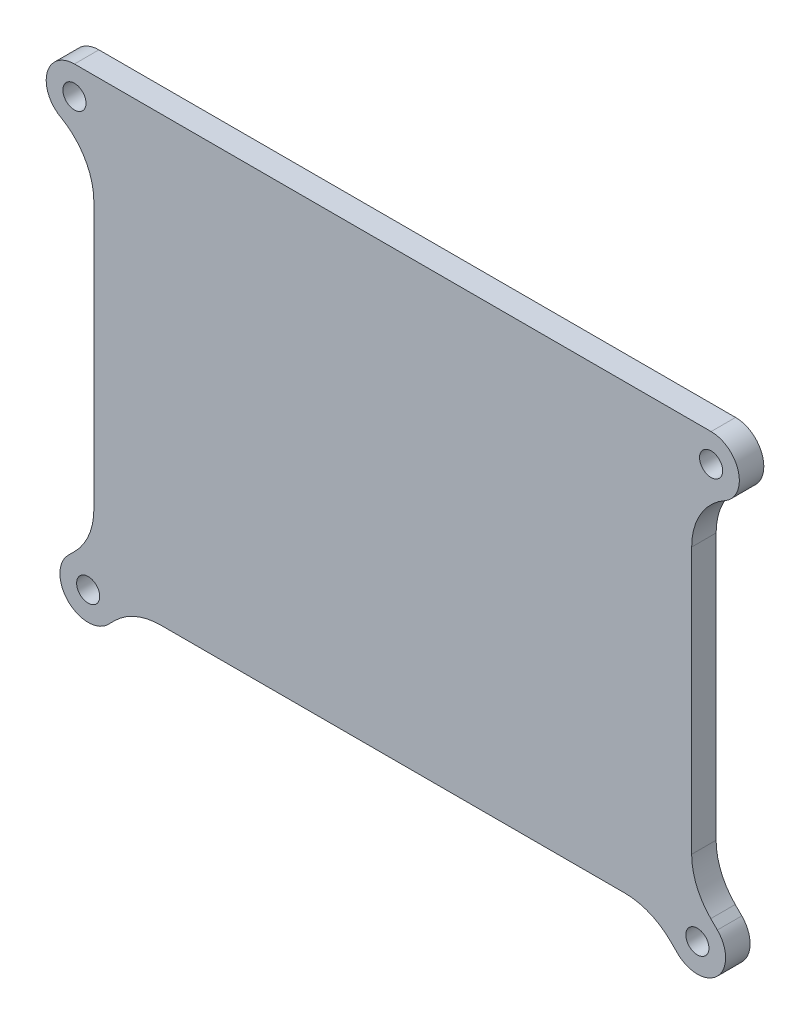
ISO-10303-21;
HEADER;
FILE_DESCRIPTION(('STEP AP214'),'2;1');
FILE_NAME('part.step','',(''),(''),'','','');
FILE_SCHEMA(('AUTOMOTIVE_DESIGN { 1 0 10303 214 1 1 1 1 }'));
ENDSEC;
DATA;
#1=APPLICATION_CONTEXT('core data for automotive mechanical design processes');
#2=APPLICATION_PROTOCOL_DEFINITION('international standard','automotive_design',2000,#1);
#3=PRODUCT_CONTEXT('',#1,'mechanical');
#4=PRODUCT('Part','Part','',(#3));
#5=PRODUCT_RELATED_PRODUCT_CATEGORY('part','',(#4));
#6=PRODUCT_DEFINITION_FORMATION('','',#4);
#7=PRODUCT_DEFINITION_CONTEXT('part definition',#1,'design');
#8=PRODUCT_DEFINITION('design','',#6,#7);
#9=PRODUCT_DEFINITION_SHAPE('','',#8);
#10=(LENGTH_UNIT() NAMED_UNIT(*) SI_UNIT(.MILLI.,.METRE.));
#11=(NAMED_UNIT(*) PLANE_ANGLE_UNIT() SI_UNIT($,.RADIAN.));
#12=(NAMED_UNIT(*) SI_UNIT($,.STERADIAN.) SOLID_ANGLE_UNIT());
#13=UNCERTAINTY_MEASURE_WITH_UNIT(LENGTH_MEASURE(1.E-05),#10,'distance_accuracy_value','');
#14=(GEOMETRIC_REPRESENTATION_CONTEXT(3) GLOBAL_UNCERTAINTY_ASSIGNED_CONTEXT((#13)) GLOBAL_UNIT_ASSIGNED_CONTEXT((#10,
#11,#12)) REPRESENTATION_CONTEXT('',''));
#15=CARTESIAN_POINT('',(0.,0.,0.));
#16=DIRECTION('',(0.,0.,1.));
#17=DIRECTION('',(1.,0.,0.));
#18=AXIS2_PLACEMENT_3D('',#15,#16,#17);
#19=CARTESIAN_POINT('',(-61.96395,37.6,4.7625));
#20=DIRECTION('',(0.,0.,-1.));
#21=DIRECTION('',(-1.,0.,0.));
#22=AXIS2_PLACEMENT_3D('',#19,#20,#21);
#23=CYLINDRICAL_SURFACE('',#22,5.5);
#24=CARTESIAN_POINT('',(-61.96395,37.6,0.));
#25=DIRECTION('',(0.,0.,1.));
#26=DIRECTION('',(1.,0.,0.));
#27=AXIS2_PLACEMENT_3D('',#24,#25,#26);
#28=CIRCLE('',#27,5.5);
#29=CARTESIAN_POINT('',(-61.96395,43.1,0.));
#30=VERTEX_POINT('',#29);
#31=CARTESIAN_POINT('',(-64.6587384615384,32.8054077183186,0.));
#32=VERTEX_POINT('',#31);
#33=EDGE_CURVE('E192',#30,#32,#28,.T.);
#34=ORIENTED_EDGE('',*,*,#33,.T.);
#35=DIRECTION('',(0.,0.,-1.));
#36=VECTOR('',#35,1.);
#37=CARTESIAN_POINT('',(-64.6587384615384,32.8054077183186,4.7625));
#38=LINE('',#37,#36);
#39=CARTESIAN_POINT('',(-64.6587384615384,32.8054077183186,4.7625));
#40=VERTEX_POINT('',#39);
#41=EDGE_CURVE('E11',#40,#32,#38,.T.);
#42=ORIENTED_EDGE('',*,*,#41,.F.);
#43=CARTESIAN_POINT('',(-61.96395,37.6,4.7625));
#44=DIRECTION('',(0.,0.,1.));
#45=DIRECTION('',(1.,0.,0.));
#46=AXIS2_PLACEMENT_3D('',#43,#44,#45);
#47=CIRCLE('',#46,5.5);
#48=CARTESIAN_POINT('',(-61.96395,43.1,4.7625));
#49=VERTEX_POINT('',#48);
#50=EDGE_CURVE('E227',#49,#40,#47,.T.);
#51=ORIENTED_EDGE('',*,*,#50,.F.);
#52=DIRECTION('',(0.,0.,-1.));
#53=VECTOR('',#52,1.);
#54=CARTESIAN_POINT('',(-61.96395,43.1,4.7625));
#55=LINE('',#54,#53);
#56=EDGE_CURVE('E188',#49,#30,#55,.T.);
#57=ORIENTED_EDGE('',*,*,#56,.T.);
#58=EDGE_LOOP('',(#34,#42,#51,#57));
#59=FACE_BOUND('',#58,.T.);
#60=ADVANCED_FACE('F36',(#59),#23,.T.);
#61=CARTESIAN_POINT('',(-70.88125,21.7342582678905,4.7625));
#62=DIRECTION('',(0.,0.,-1.));
#63=DIRECTION('',(-1.,0.,0.));
#64=AXIS2_PLACEMENT_3D('',#61,#62,#63);
#65=CYLINDRICAL_SURFACE('',#64,12.7);
#66=CARTESIAN_POINT('',(-70.88125,21.7342582678905,0.));
#67=DIRECTION('',(0.,0.,-1.));
#68=DIRECTION('',(1.,0.,0.));
#69=AXIS2_PLACEMENT_3D('',#66,#67,#68);
#70=CIRCLE('',#69,12.7);
#71=CARTESIAN_POINT('',(-58.18125,21.7342582678905,0.));
#72=VERTEX_POINT('',#71);
#73=EDGE_CURVE('E195',#32,#72,#70,.T.);
#74=ORIENTED_EDGE('',*,*,#73,.T.);
#75=DIRECTION('',(0.,0.,-1.));
#76=VECTOR('',#75,1.);
#77=CARTESIAN_POINT('',(-58.18125,21.7342582678905,4.7625));
#78=LINE('',#77,#76);
#79=CARTESIAN_POINT('',(-58.18125,21.7342582678905,4.7625));
#80=VERTEX_POINT('',#79);
#81=EDGE_CURVE('E44',#80,#72,#78,.T.);
#82=ORIENTED_EDGE('',*,*,#81,.F.);
#83=CARTESIAN_POINT('',(-70.88125,21.7342582678905,4.7625));
#84=DIRECTION('',(0.,0.,-1.));
#85=DIRECTION('',(1.,0.,0.));
#86=AXIS2_PLACEMENT_3D('',#83,#84,#85);
#87=CIRCLE('',#86,12.7);
#88=EDGE_CURVE('E125',#40,#80,#87,.T.);
#89=ORIENTED_EDGE('',*,*,#88,.F.);
#90=ORIENTED_EDGE('',*,*,#41,.T.);
#91=EDGE_LOOP('',(#74,#82,#89,#90));
#92=FACE_BOUND('',#91,.T.);
#93=ADVANCED_FACE('F336',(#92),#65,.F.);
#94=CARTESIAN_POINT('',(-58.18125,21.7342582678905,4.7625));
#95=DIRECTION('',(1.,0.,0.));
#96=DIRECTION('',(0.,0.,-1.));
#97=AXIS2_PLACEMENT_3D('',#94,#95,#96);
#98=PLANE('',#97);
#99=DIRECTION('',(0.,-1.,0.));
#100=VECTOR('',#99,1.);
#101=CARTESIAN_POINT('',(-58.18125,21.7342582678905,0.));
#102=LINE('',#101,#100);
#103=CARTESIAN_POINT('',(-58.18125,-30.0613131648097,0.));
#104=VERTEX_POINT('',#103);
#105=EDGE_CURVE('E198',#72,#104,#102,.T.);
#106=ORIENTED_EDGE('',*,*,#105,.T.);
#107=DIRECTION('',(0.,0.,-1.));
#108=VECTOR('',#107,1.);
#109=CARTESIAN_POINT('',(-58.18125,-30.0613131648097,4.7625));
#110=LINE('',#109,#108);
#111=CARTESIAN_POINT('',(-58.18125,-30.0613131648097,4.7625));
#112=VERTEX_POINT('',#111);
#113=EDGE_CURVE('E264',#112,#104,#110,.T.);
#114=ORIENTED_EDGE('',*,*,#113,.F.);
#115=DIRECTION('',(0.,-1.,0.));
#116=VECTOR('',#115,1.);
#117=CARTESIAN_POINT('',(-58.18125,21.7342582678905,4.7625));
#118=LINE('',#117,#116);
#119=EDGE_CURVE('E272',#80,#112,#118,.T.);
#120=ORIENTED_EDGE('',*,*,#119,.F.);
#121=ORIENTED_EDGE('',*,*,#81,.T.);
#122=EDGE_LOOP('',(#106,#114,#120,#121));
#123=FACE_BOUND('',#122,.T.);
#124=ADVANCED_FACE('F270',(#123),#98,.F.);
#125=CARTESIAN_POINT('',(-70.88125,-30.0613131648097,4.7625));
#126=DIRECTION('',(0.,0.,-1.));
#127=DIRECTION('',(-1.,0.,0.));
#128=AXIS2_PLACEMENT_3D('',#125,#126,#127);
#129=CYLINDRICAL_SURFACE('',#128,12.7);
#130=CARTESIAN_POINT('',(-70.88125,-30.0613131648097,0.));
#131=DIRECTION('',(0.,0.,-1.));
#132=DIRECTION('',(1.,0.,0.));
#133=AXIS2_PLACEMENT_3D('',#130,#131,#132);
#134=CIRCLE('',#133,12.7);
#135=CARTESIAN_POINT('',(-61.9009938789308,-39.0415692858788,0.));
#136=VERTEX_POINT('',#135);
#137=EDGE_CURVE('E200',#104,#136,#134,.T.);
#138=ORIENTED_EDGE('',*,*,#137,.T.);
#139=DIRECTION('',(0.,0.,-1.));
#140=VECTOR('',#139,1.);
#141=CARTESIAN_POINT('',(-61.9009938789308,-39.0415692858788,4.7625));
#142=LINE('',#141,#140);
#143=CARTESIAN_POINT('',(-61.9009938789308,-39.0415692858788,4.7625));
#144=VERTEX_POINT('',#143);
#145=EDGE_CURVE('E261',#144,#136,#142,.T.);
#146=ORIENTED_EDGE('',*,*,#145,.F.);
#147=CARTESIAN_POINT('',(-70.88125,-30.0613131648097,4.7625));
#148=DIRECTION('',(0.,0.,-1.));
#149=DIRECTION('',(1.,0.,0.));
#150=AXIS2_PLACEMENT_3D('',#147,#148,#149);
#151=CIRCLE('',#150,12.7);
#152=EDGE_CURVE('E290',#112,#144,#151,.T.);
#153=ORIENTED_EDGE('',*,*,#152,.F.);
#154=ORIENTED_EDGE('',*,*,#113,.T.);
#155=EDGE_LOOP('',(#138,#146,#153,#154));
#156=FACE_BOUND('',#155,.T.);
#157=ADVANCED_FACE('F281',(#156),#129,.F.);
#158=CARTESIAN_POINT('',(-61.9009938789308,-39.0415692858788,4.7625));
#159=DIRECTION('',(0.707106781186551,-0.707106781186544,0.));
#160=DIRECTION('',(0.707106781186544,0.707106781186551,0.));
#161=AXIS2_PLACEMENT_3D('',#158,#159,#160);
#162=PLANE('',#161);
#163=DIRECTION('',(-0.707106781186544,-0.707106781186551,0.));
#164=VECTOR('',#163,1.);
#165=CARTESIAN_POINT('',(-61.9009938789308,-39.0415692858788,0.));
#166=LINE('',#165,#164);
#167=CARTESIAN_POINT('',(-63.1828176885694,-40.3233930955174,0.));
#168=VERTEX_POINT('',#167);
#169=EDGE_CURVE('E202',#136,#168,#166,.T.);
#170=ORIENTED_EDGE('',*,*,#169,.T.);
#171=DIRECTION('',(0.,0.,-1.));
#172=VECTOR('',#171,1.);
#173=CARTESIAN_POINT('',(-63.1828176885694,-40.3233930955174,4.7625));
#174=LINE('',#173,#172);
#175=CARTESIAN_POINT('',(-63.1828176885694,-40.3233930955174,4.7625));
#176=VERTEX_POINT('',#175);
#177=EDGE_CURVE('E258',#176,#168,#174,.T.);
#178=ORIENTED_EDGE('',*,*,#177,.F.);
#179=DIRECTION('',(-0.707106781186544,-0.707106781186551,0.));
#180=VECTOR('',#179,1.);
#181=CARTESIAN_POINT('',(-61.9009938789308,-39.0415692858788,4.7625));
#182=LINE('',#181,#180);
#183=EDGE_CURVE('E287',#144,#176,#182,.T.);
#184=ORIENTED_EDGE('',*,*,#183,.F.);
#185=ORIENTED_EDGE('',*,*,#145,.T.);
#186=EDGE_LOOP('',(#170,#178,#184,#185));
#187=FACE_BOUND('',#186,.T.);
#188=ADVANCED_FACE('F285',(#187),#162,.F.);
#189=CARTESIAN_POINT('',(-59.2937303920434,-44.2124803920434,4.7625));
#190=DIRECTION('',(0.,0.,-1.));
#191=DIRECTION('',(-1.,0.,0.));
#192=AXIS2_PLACEMENT_3D('',#189,#190,#191);
#193=CYLINDRICAL_SURFACE('',#192,5.5);
#194=CARTESIAN_POINT('',(-59.2937303920434,-44.2124803920434,0.));
#195=DIRECTION('',(0.,0.,1.));
#196=DIRECTION('',(1.,0.,0.));
#197=AXIS2_PLACEMENT_3D('',#194,#195,#196);
#198=CIRCLE('',#197,5.5);
#199=CARTESIAN_POINT('',(-55.4046430955174,-48.1015676885694,0.));
#200=VERTEX_POINT('',#199);
#201=EDGE_CURVE('E204',#168,#200,#198,.T.);
#202=ORIENTED_EDGE('',*,*,#201,.T.);
#203=DIRECTION('',(0.,0.,-1.));
#204=VECTOR('',#203,1.);
#205=CARTESIAN_POINT('',(-55.4046430955174,-48.1015676885694,4.7625));
#206=LINE('',#205,#204);
#207=CARTESIAN_POINT('',(-55.4046430955174,-48.1015676885694,4.7625));
#208=VERTEX_POINT('',#207);
#209=EDGE_CURVE('E255',#208,#200,#206,.T.);
#210=ORIENTED_EDGE('',*,*,#209,.F.);
#211=CARTESIAN_POINT('',(-59.2937303920434,-44.2124803920434,4.7625));
#212=DIRECTION('',(0.,0.,1.));
#213=DIRECTION('',(1.,0.,0.));
#214=AXIS2_PLACEMENT_3D('',#211,#212,#213);
#215=CIRCLE('',#214,5.5);
#216=EDGE_CURVE('E289',#176,#208,#215,.T.);
#217=ORIENTED_EDGE('',*,*,#216,.F.);
#218=ORIENTED_EDGE('',*,*,#177,.T.);
#219=EDGE_LOOP('',(#202,#210,#217,#218));
#220=FACE_BOUND('',#219,.T.);
#221=ADVANCED_FACE('F349',(#220),#193,.T.);
#222=CARTESIAN_POINT('',(-55.4046430955174,-48.1015676885694,4.7625));
#223=DIRECTION('',(-0.707106781186546,0.707106781186549,0.));
#224=DIRECTION('',(-0.707106781186549,-0.707106781186546,0.));
#225=AXIS2_PLACEMENT_3D('',#222,#223,#224);
#226=PLANE('',#225);
#227=DIRECTION('',(0.707106781186549,0.707106781186546,0.));
#228=VECTOR('',#227,1.);
#229=CARTESIAN_POINT('',(-55.4046430955174,-48.1015676885694,0.));
#230=LINE('',#229,#228);
#231=CARTESIAN_POINT('',(-54.1228192858788,-46.8197438789309,0.));
#232=VERTEX_POINT('',#231);
#233=EDGE_CURVE('E206',#200,#232,#230,.T.);
#234=ORIENTED_EDGE('',*,*,#233,.T.);
#235=DIRECTION('',(0.,0.,-1.));
#236=VECTOR('',#235,1.);
#237=CARTESIAN_POINT('',(-54.1228192858788,-46.8197438789309,4.7625));
#238=LINE('',#237,#236);
#239=CARTESIAN_POINT('',(-54.1228192858788,-46.8197438789309,4.7625));
#240=VERTEX_POINT('',#239);
#241=EDGE_CURVE('E252',#240,#232,#238,.T.);
#242=ORIENTED_EDGE('',*,*,#241,.F.);
#243=DIRECTION('',(0.707106781186549,0.707106781186546,0.));
#244=VECTOR('',#243,1.);
#245=CARTESIAN_POINT('',(-55.4046430955174,-48.1015676885694,4.7625));
#246=LINE('',#245,#244);
#247=EDGE_CURVE('E292',#208,#240,#246,.T.);
#248=ORIENTED_EDGE('',*,*,#247,.F.);
#249=ORIENTED_EDGE('',*,*,#209,.T.);
#250=EDGE_LOOP('',(#234,#242,#248,#249));
#251=FACE_BOUND('',#250,.T.);
#252=ADVANCED_FACE('F352',(#251),#226,.F.);
#253=CARTESIAN_POINT('',(-45.1425631648097,-55.8,4.7625));
#254=DIRECTION('',(0.,0.,-1.));
#255=DIRECTION('',(-1.,0.,0.));
#256=AXIS2_PLACEMENT_3D('',#253,#254,#255);
#257=CYLINDRICAL_SURFACE('',#256,12.7);
#258=CARTESIAN_POINT('',(-45.1425631648097,-55.8,0.));
#259=DIRECTION('',(0.,0.,-1.));
#260=DIRECTION('',(1.,0.,0.));
#261=AXIS2_PLACEMENT_3D('',#258,#259,#260);
#262=CIRCLE('',#261,12.7);
#263=CARTESIAN_POINT('',(-45.1425631648097,-43.1,0.));
#264=VERTEX_POINT('',#263);
#265=EDGE_CURVE('E208',#232,#264,#262,.T.);
#266=ORIENTED_EDGE('',*,*,#265,.T.);
#267=DIRECTION('',(0.,0.,-1.));
#268=VECTOR('',#267,1.);
#269=CARTESIAN_POINT('',(-45.1425631648097,-43.1,4.7625));
#270=LINE('',#269,#268);
#271=CARTESIAN_POINT('',(-45.1425631648097,-43.1,4.7625));
#272=VERTEX_POINT('',#271);
#273=EDGE_CURVE('E249',#272,#264,#270,.T.);
#274=ORIENTED_EDGE('',*,*,#273,.F.);
#275=CARTESIAN_POINT('',(-45.1425631648097,-55.8,4.7625));
#276=DIRECTION('',(0.,0.,-1.));
#277=DIRECTION('',(1.,0.,0.));
#278=AXIS2_PLACEMENT_3D('',#275,#276,#277);
#279=CIRCLE('',#278,12.7);
#280=EDGE_CURVE('E298',#240,#272,#279,.T.);
#281=ORIENTED_EDGE('',*,*,#280,.F.);
#282=ORIENTED_EDGE('',*,*,#241,.T.);
#283=EDGE_LOOP('',(#266,#274,#281,#282));
#284=FACE_BOUND('',#283,.T.);
#285=ADVANCED_FACE('F356',(#284),#257,.F.);
#286=CARTESIAN_POINT('',(-45.1425631648097,-43.1,4.7625));
#287=DIRECTION('',(0.,1.,0.));
#288=DIRECTION('',(0.,0.,1.));
#289=AXIS2_PLACEMENT_3D('',#286,#287,#288);
#290=PLANE('',#289);
#291=DIRECTION('',(1.,0.,0.));
#292=VECTOR('',#291,1.);
#293=CARTESIAN_POINT('',(-45.1425631648097,-43.1,0.));
#294=LINE('',#293,#292);
#295=CARTESIAN_POINT('',(45.1425631648097,-43.1,0.));
#296=VERTEX_POINT('',#295);
#297=EDGE_CURVE('E210',#264,#296,#294,.T.);
#298=ORIENTED_EDGE('',*,*,#297,.T.);
#299=DIRECTION('',(0.,0.,-1.));
#300=VECTOR('',#299,1.);
#301=CARTESIAN_POINT('',(45.1425631648097,-43.1,4.7625));
#302=LINE('',#301,#300);
#303=CARTESIAN_POINT('',(45.1425631648097,-43.1,4.7625));
#304=VERTEX_POINT('',#303);
#305=EDGE_CURVE('E246',#304,#296,#302,.T.);
#306=ORIENTED_EDGE('',*,*,#305,.F.);
#307=DIRECTION('',(1.,0.,0.));
#308=VECTOR('',#307,1.);
#309=CARTESIAN_POINT('',(-45.1425631648097,-43.1,4.7625));
#310=LINE('',#309,#308);
#311=EDGE_CURVE('E300',#272,#304,#310,.T.);
#312=ORIENTED_EDGE('',*,*,#311,.F.);
#313=ORIENTED_EDGE('',*,*,#273,.T.);
#314=EDGE_LOOP('',(#298,#306,#312,#313));
#315=FACE_BOUND('',#314,.T.);
#316=ADVANCED_FACE('F360',(#315),#290,.F.);
#317=CARTESIAN_POINT('',(45.1425631648097,-55.8,4.7625));
#318=DIRECTION('',(0.,0.,-1.));
#319=DIRECTION('',(-1.,0.,0.));
#320=AXIS2_PLACEMENT_3D('',#317,#318,#319);
#321=CYLINDRICAL_SURFACE('',#320,12.7);
#322=CARTESIAN_POINT('',(45.1425631648097,-55.8,0.));
#323=DIRECTION('',(0.,0.,-1.));
#324=DIRECTION('',(1.,0.,0.));
#325=AXIS2_PLACEMENT_3D('',#322,#323,#324);
#326=CIRCLE('',#325,12.7);
#327=CARTESIAN_POINT('',(54.1228192858788,-46.8197438789309,0.));
#328=VERTEX_POINT('',#327);
#329=EDGE_CURVE('E212',#296,#328,#326,.T.);
#330=ORIENTED_EDGE('',*,*,#329,.T.);
#331=DIRECTION('',(0.,0.,-1.));
#332=VECTOR('',#331,1.);
#333=CARTESIAN_POINT('',(54.1228192858788,-46.8197438789309,4.7625));
#334=LINE('',#333,#332);
#335=CARTESIAN_POINT('',(54.1228192858788,-46.8197438789309,4.7625));
#336=VERTEX_POINT('',#335);
#337=EDGE_CURVE('E243',#336,#328,#334,.T.);
#338=ORIENTED_EDGE('',*,*,#337,.F.);
#339=CARTESIAN_POINT('',(45.1425631648097,-55.8,4.7625));
#340=DIRECTION('',(0.,0.,-1.));
#341=DIRECTION('',(1.,0.,0.));
#342=AXIS2_PLACEMENT_3D('',#339,#340,#341);
#343=CIRCLE('',#342,12.7);
#344=EDGE_CURVE('E302',#304,#336,#343,.T.);
#345=ORIENTED_EDGE('',*,*,#344,.F.);
#346=ORIENTED_EDGE('',*,*,#305,.T.);
#347=EDGE_LOOP('',(#330,#338,#345,#346));
#348=FACE_BOUND('',#347,.T.);
#349=ADVANCED_FACE('F364',(#348),#321,.F.);
#350=CARTESIAN_POINT('',(54.1228192858788,-46.8197438789309,4.7625));
#351=DIRECTION('',(0.707106781186546,0.707106781186549,0.));
#352=DIRECTION('',(-0.707106781186549,0.707106781186546,0.));
#353=AXIS2_PLACEMENT_3D('',#350,#351,#352);
#354=PLANE('',#353);
#355=DIRECTION('',(0.707106781186549,-0.707106781186546,0.));
#356=VECTOR('',#355,1.);
#357=CARTESIAN_POINT('',(54.1228192858788,-46.8197438789309,0.));
#358=LINE('',#357,#356);
#359=CARTESIAN_POINT('',(55.4046430955174,-48.1015676885694,0.));
#360=VERTEX_POINT('',#359);
#361=EDGE_CURVE('E214',#328,#360,#358,.T.);
#362=ORIENTED_EDGE('',*,*,#361,.T.);
#363=DIRECTION('',(0.,0.,-1.));
#364=VECTOR('',#363,1.);
#365=CARTESIAN_POINT('',(55.4046430955174,-48.1015676885694,4.7625));
#366=LINE('',#365,#364);
#367=CARTESIAN_POINT('',(55.4046430955174,-48.1015676885694,4.7625));
#368=VERTEX_POINT('',#367);
#369=EDGE_CURVE('E240',#368,#360,#366,.T.);
#370=ORIENTED_EDGE('',*,*,#369,.F.);
#371=DIRECTION('',(0.707106781186549,-0.707106781186546,0.));
#372=VECTOR('',#371,1.);
#373=CARTESIAN_POINT('',(54.1228192858788,-46.8197438789309,4.7625));
#374=LINE('',#373,#372);
#375=EDGE_CURVE('E304',#336,#368,#374,.T.);
#376=ORIENTED_EDGE('',*,*,#375,.F.);
#377=ORIENTED_EDGE('',*,*,#337,.T.);
#378=EDGE_LOOP('',(#362,#370,#376,#377));
#379=FACE_BOUND('',#378,.T.);
#380=ADVANCED_FACE('F368',(#379),#354,.F.);
#381=CARTESIAN_POINT('',(59.2937303920434,-44.2124803920434,4.7625));
#382=DIRECTION('',(0.,0.,-1.));
#383=DIRECTION('',(-1.,0.,0.));
#384=AXIS2_PLACEMENT_3D('',#381,#382,#383);
#385=CYLINDRICAL_SURFACE('',#384,5.5);
#386=CARTESIAN_POINT('',(59.2937303920434,-44.2124803920434,0.));
#387=DIRECTION('',(0.,0.,1.));
#388=DIRECTION('',(1.,0.,0.));
#389=AXIS2_PLACEMENT_3D('',#386,#387,#388);
#390=CIRCLE('',#389,5.5);
#391=CARTESIAN_POINT('',(63.1828176885694,-40.3233930955174,0.));
#392=VERTEX_POINT('',#391);
#393=EDGE_CURVE('E216',#360,#392,#390,.T.);
#394=ORIENTED_EDGE('',*,*,#393,.T.);
#395=DIRECTION('',(0.,0.,-1.));
#396=VECTOR('',#395,1.);
#397=CARTESIAN_POINT('',(63.1828176885694,-40.3233930955174,4.7625));
#398=LINE('',#397,#396);
#399=CARTESIAN_POINT('',(63.1828176885694,-40.3233930955174,4.7625));
#400=VERTEX_POINT('',#399);
#401=EDGE_CURVE('E237',#400,#392,#398,.T.);
#402=ORIENTED_EDGE('',*,*,#401,.F.);
#403=CARTESIAN_POINT('',(59.2937303920434,-44.2124803920434,4.7625));
#404=DIRECTION('',(0.,0.,1.));
#405=DIRECTION('',(1.,0.,0.));
#406=AXIS2_PLACEMENT_3D('',#403,#404,#405);
#407=CIRCLE('',#406,5.5);
#408=EDGE_CURVE('E306',#368,#400,#407,.T.);
#409=ORIENTED_EDGE('',*,*,#408,.F.);
#410=ORIENTED_EDGE('',*,*,#369,.T.);
#411=EDGE_LOOP('',(#394,#402,#409,#410));
#412=FACE_BOUND('',#411,.T.);
#413=ADVANCED_FACE('F372',(#412),#385,.T.);
#414=CARTESIAN_POINT('',(63.1828176885694,-40.3233930955174,4.7625));
#415=DIRECTION('',(-0.707106781186549,-0.707106781186546,0.));
#416=DIRECTION('',(0.707106781186546,-0.707106781186549,0.));
#417=AXIS2_PLACEMENT_3D('',#414,#415,#416);
#418=PLANE('',#417);
#419=DIRECTION('',(-0.707106781186546,0.70710678118655,0.));
#420=VECTOR('',#419,1.);
#421=CARTESIAN_POINT('',(63.1828176885694,-40.3233930955174,0.));
#422=LINE('',#421,#420);
#423=CARTESIAN_POINT('',(61.9009938789309,-39.0415692858788,0.));
#424=VERTEX_POINT('',#423);
#425=EDGE_CURVE('E218',#392,#424,#422,.T.);
#426=ORIENTED_EDGE('',*,*,#425,.T.);
#427=DIRECTION('',(0.,0.,-1.));
#428=VECTOR('',#427,1.);
#429=CARTESIAN_POINT('',(61.9009938789309,-39.0415692858788,4.7625));
#430=LINE('',#429,#428);
#431=CARTESIAN_POINT('',(61.9009938789309,-39.0415692858788,4.7625));
#432=VERTEX_POINT('',#431);
#433=EDGE_CURVE('E234',#432,#424,#430,.T.);
#434=ORIENTED_EDGE('',*,*,#433,.F.);
#435=DIRECTION('',(-0.707106781186546,0.70710678118655,0.));
#436=VECTOR('',#435,1.);
#437=CARTESIAN_POINT('',(63.1828176885694,-40.3233930955174,4.7625));
#438=LINE('',#437,#436);
#439=EDGE_CURVE('E308',#400,#432,#438,.T.);
#440=ORIENTED_EDGE('',*,*,#439,.F.);
#441=ORIENTED_EDGE('',*,*,#401,.T.);
#442=EDGE_LOOP('',(#426,#434,#440,#441));
#443=FACE_BOUND('',#442,.T.);
#444=ADVANCED_FACE('F376',(#443),#418,.F.);
#445=CARTESIAN_POINT('',(70.88125,-30.0613131648097,4.7625));
#446=DIRECTION('',(0.,0.,-1.));
#447=DIRECTION('',(-1.,0.,0.));
#448=AXIS2_PLACEMENT_3D('',#445,#446,#447);
#449=CYLINDRICAL_SURFACE('',#448,12.7);
#450=CARTESIAN_POINT('',(70.88125,-30.0613131648097,0.));
#451=DIRECTION('',(0.,0.,-1.));
#452=DIRECTION('',(1.,0.,0.));
#453=AXIS2_PLACEMENT_3D('',#450,#451,#452);
#454=CIRCLE('',#453,12.7);
#455=CARTESIAN_POINT('',(58.18125,-30.0613131648097,0.));
#456=VERTEX_POINT('',#455);
#457=EDGE_CURVE('E220',#424,#456,#454,.T.);
#458=ORIENTED_EDGE('',*,*,#457,.T.);
#459=DIRECTION('',(0.,0.,-1.));
#460=VECTOR('',#459,1.);
#461=CARTESIAN_POINT('',(58.18125,-30.0613131648097,4.7625));
#462=LINE('',#461,#460);
#463=CARTESIAN_POINT('',(58.18125,-30.0613131648097,4.7625));
#464=VERTEX_POINT('',#463);
#465=EDGE_CURVE('E231',#464,#456,#462,.T.);
#466=ORIENTED_EDGE('',*,*,#465,.F.);
#467=CARTESIAN_POINT('',(70.88125,-30.0613131648097,4.7625));
#468=DIRECTION('',(0.,0.,-1.));
#469=DIRECTION('',(1.,0.,0.));
#470=AXIS2_PLACEMENT_3D('',#467,#468,#469);
#471=CIRCLE('',#470,12.7);
#472=EDGE_CURVE('E310',#432,#464,#471,.T.);
#473=ORIENTED_EDGE('',*,*,#472,.F.);
#474=ORIENTED_EDGE('',*,*,#433,.T.);
#475=EDGE_LOOP('',(#458,#466,#473,#474));
#476=FACE_BOUND('',#475,.T.);
#477=ADVANCED_FACE('F316',(#476),#449,.F.);
#478=CARTESIAN_POINT('',(58.18125,-30.0613131648097,4.7625));
#479=DIRECTION('',(-1.,0.,0.));
#480=DIRECTION('',(0.,-1.,0.));
#481=AXIS2_PLACEMENT_3D('',#478,#479,#480);
#482=PLANE('',#481);
#483=DIRECTION('',(0.,1.,0.));
#484=VECTOR('',#483,1.);
#485=CARTESIAN_POINT('',(58.18125,-30.0613131648097,0.));
#486=LINE('',#485,#484);
#487=CARTESIAN_POINT('',(58.18125,21.7342582678905,0.));
#488=VERTEX_POINT('',#487);
#489=EDGE_CURVE('E222',#456,#488,#486,.T.);
#490=ORIENTED_EDGE('',*,*,#489,.T.);
#491=DIRECTION('',(0.,0.,-1.));
#492=VECTOR('',#491,1.);
#493=CARTESIAN_POINT('',(58.18125,21.7342582678905,4.7625));
#494=LINE('',#493,#492);
#495=CARTESIAN_POINT('',(58.18125,21.7342582678905,4.7625));
#496=VERTEX_POINT('',#495);
#497=EDGE_CURVE('E183',#496,#488,#494,.T.);
#498=ORIENTED_EDGE('',*,*,#497,.F.);
#499=DIRECTION('',(0.,1.,0.));
#500=VECTOR('',#499,1.);
#501=CARTESIAN_POINT('',(58.18125,-30.0613131648097,4.7625));
#502=LINE('',#501,#500);
#503=EDGE_CURVE('E174',#464,#496,#502,.T.);
#504=ORIENTED_EDGE('',*,*,#503,.F.);
#505=ORIENTED_EDGE('',*,*,#465,.T.);
#506=EDGE_LOOP('',(#490,#498,#504,#505));
#507=FACE_BOUND('',#506,.T.);
#508=ADVANCED_FACE('F320',(#507),#482,.F.);
#509=CARTESIAN_POINT('',(70.88125,21.7342582678905,4.7625));
#510=DIRECTION('',(0.,0.,-1.));
#511=DIRECTION('',(-1.,0.,0.));
#512=AXIS2_PLACEMENT_3D('',#509,#510,#511);
#513=CYLINDRICAL_SURFACE('',#512,12.7);
#514=CARTESIAN_POINT('',(70.88125,21.7342582678905,0.));
#515=DIRECTION('',(0.,0.,-1.));
#516=DIRECTION('',(1.,0.,0.));
#517=AXIS2_PLACEMENT_3D('',#514,#515,#516);
#518=CIRCLE('',#517,12.7);
#519=CARTESIAN_POINT('',(64.6587384615384,32.8054077183186,0.));
#520=VERTEX_POINT('',#519);
#521=EDGE_CURVE('E182',#488,#520,#518,.T.);
#522=ORIENTED_EDGE('',*,*,#521,.T.);
#523=DIRECTION('',(0.,0.,-1.));
#524=VECTOR('',#523,1.);
#525=CARTESIAN_POINT('',(64.6587384615384,32.8054077183186,4.7625));
#526=LINE('',#525,#524);
#527=CARTESIAN_POINT('',(64.6587384615384,32.8054077183186,4.7625));
#528=VERTEX_POINT('',#527);
#529=EDGE_CURVE('E179',#528,#520,#526,.T.);
#530=ORIENTED_EDGE('',*,*,#529,.F.);
#531=CARTESIAN_POINT('',(70.88125,21.7342582678905,4.7625));
#532=DIRECTION('',(0.,0.,-1.));
#533=DIRECTION('',(1.,0.,0.));
#534=AXIS2_PLACEMENT_3D('',#531,#532,#533);
#535=CIRCLE('',#534,12.7);
#536=EDGE_CURVE('E168',#496,#528,#535,.T.);
#537=ORIENTED_EDGE('',*,*,#536,.F.);
#538=ORIENTED_EDGE('',*,*,#497,.T.);
#539=EDGE_LOOP('',(#522,#530,#537,#538));
#540=FACE_BOUND('',#539,.T.);
#541=ADVANCED_FACE('F180',(#540),#513,.F.);
#542=CARTESIAN_POINT('',(61.96395,37.6,4.7625));
#543=DIRECTION('',(0.,0.,-1.));
#544=DIRECTION('',(-1.,0.,0.));
#545=AXIS2_PLACEMENT_3D('',#542,#543,#544);
#546=CYLINDRICAL_SURFACE('',#545,5.5);
#547=CARTESIAN_POINT('',(61.96395,37.6,0.));
#548=DIRECTION('',(0.,0.,1.));
#549=DIRECTION('',(1.,0.,0.));
#550=AXIS2_PLACEMENT_3D('',#547,#548,#549);
#551=CIRCLE('',#550,5.5);
#552=CARTESIAN_POINT('',(61.96395,43.1,0.));
#553=VERTEX_POINT('',#552);
#554=EDGE_CURVE('E111',#520,#553,#551,.T.);
#555=ORIENTED_EDGE('',*,*,#554,.T.);
#556=DIRECTION('',(0.,0.,-1.));
#557=VECTOR('',#556,1.);
#558=CARTESIAN_POINT('',(61.96395,43.1,4.7625));
#559=LINE('',#558,#557);
#560=CARTESIAN_POINT('',(61.96395,43.1,4.7625));
#561=VERTEX_POINT('',#560);
#562=EDGE_CURVE('E184',#561,#553,#559,.T.);
#563=ORIENTED_EDGE('',*,*,#562,.F.);
#564=CARTESIAN_POINT('',(61.96395,37.6,4.7625));
#565=DIRECTION('',(0.,0.,1.));
#566=DIRECTION('',(1.,0.,0.));
#567=AXIS2_PLACEMENT_3D('',#564,#565,#566);
#568=CIRCLE('',#567,5.5);
#569=EDGE_CURVE('E172',#528,#561,#568,.T.);
#570=ORIENTED_EDGE('',*,*,#569,.F.);
#571=ORIENTED_EDGE('',*,*,#529,.T.);
#572=EDGE_LOOP('',(#555,#563,#570,#571));
#573=FACE_BOUND('',#572,.T.);
#574=ADVANCED_FACE('F186',(#573),#546,.T.);
#575=CARTESIAN_POINT('',(61.96395,43.1,4.7625));
#576=DIRECTION('',(0.,-1.,0.));
#577=DIRECTION('',(0.,0.,-1.));
#578=AXIS2_PLACEMENT_3D('',#575,#576,#577);
#579=PLANE('',#578);
#580=DIRECTION('',(-1.,0.,0.));
#581=VECTOR('',#580,1.);
#582=CARTESIAN_POINT('',(61.96395,43.1,0.));
#583=LINE('',#582,#581);
#584=EDGE_CURVE('E117',#553,#30,#583,.T.);
#585=ORIENTED_EDGE('',*,*,#584,.T.);
#586=ORIENTED_EDGE('',*,*,#56,.F.);
#587=DIRECTION('',(-1.,0.,0.));
#588=VECTOR('',#587,1.);
#589=CARTESIAN_POINT('',(61.96395,43.1,4.7625));
#590=LINE('',#589,#588);
#591=EDGE_CURVE('E52',#561,#49,#590,.T.);
#592=ORIENTED_EDGE('',*,*,#591,.F.);
#593=ORIENTED_EDGE('',*,*,#562,.T.);
#594=EDGE_LOOP('',(#585,#586,#592,#593));
#595=FACE_BOUND('',#594,.T.);
#596=ADVANCED_FACE('F324',(#595),#579,.F.);
#597=CARTESIAN_POINT('',(-61.96395,37.6,4.7625));
#598=DIRECTION('',(0.,0.,1.));
#599=DIRECTION('',(1.,0.,0.));
#600=AXIS2_PLACEMENT_3D('',#597,#598,#599);
#601=PLANE('',#600);
#602=CARTESIAN_POINT('',(-59.2937303920434,-44.2124803920434,4.7625));
#603=DIRECTION('',(0.,0.,1.));
#604=DIRECTION('',(1.,0.,0.));
#605=AXIS2_PLACEMENT_3D('',#602,#603,#604);
#606=CIRCLE('',#605,2.24999999999999);
#607=CARTESIAN_POINT('',(-57.0437303920434,-44.2124803920434,4.7625));
#608=VERTEX_POINT('',#607);
#609=EDGE_CURVE('E462',#608,#608,#606,.T.);
#610=ORIENTED_EDGE('',*,*,#609,.F.);
#611=EDGE_LOOP('',(#610));
#612=FACE_BOUND('',#611,.T.);
#613=CARTESIAN_POINT('',(-61.96395,37.6,4.7625));
#614=DIRECTION('',(0.,0.,1.));
#615=DIRECTION('',(1.,0.,0.));
#616=AXIS2_PLACEMENT_3D('',#613,#614,#615);
#617=CIRCLE('',#616,2.24999999999999);
#618=CARTESIAN_POINT('',(-59.71395,37.6,4.7625));
#619=VERTEX_POINT('',#618);
#620=EDGE_CURVE('E464',#619,#619,#617,.T.);
#621=ORIENTED_EDGE('',*,*,#620,.F.);
#622=EDGE_LOOP('',(#621));
#623=FACE_BOUND('',#622,.T.);
#624=CARTESIAN_POINT('',(61.96395,37.6,4.7625));
#625=DIRECTION('',(0.,0.,1.));
#626=DIRECTION('',(1.,0.,0.));
#627=AXIS2_PLACEMENT_3D('',#624,#625,#626);
#628=CIRCLE('',#627,2.25);
#629=CARTESIAN_POINT('',(64.21395,37.6,4.7625));
#630=VERTEX_POINT('',#629);
#631=EDGE_CURVE('E472',#630,#630,#628,.T.);
#632=ORIENTED_EDGE('',*,*,#631,.F.);
#633=EDGE_LOOP('',(#632));
#634=FACE_BOUND('',#633,.T.);
#635=CARTESIAN_POINT('',(59.2937303920434,-44.2124803920434,4.7625));
#636=DIRECTION('',(0.,0.,1.));
#637=DIRECTION('',(1.,0.,0.));
#638=AXIS2_PLACEMENT_3D('',#635,#636,#637);
#639=CIRCLE('',#638,2.24999999999999);
#640=CARTESIAN_POINT('',(61.5437303920434,-44.2124803920434,4.7625));
#641=VERTEX_POINT('',#640);
#642=EDGE_CURVE('E478',#641,#641,#639,.T.);
#643=ORIENTED_EDGE('',*,*,#642,.F.);
#644=EDGE_LOOP('',(#643));
#645=FACE_BOUND('',#644,.T.);
#646=ORIENTED_EDGE('',*,*,#50,.T.);
#647=ORIENTED_EDGE('',*,*,#88,.T.);
#648=ORIENTED_EDGE('',*,*,#119,.T.);
#649=ORIENTED_EDGE('',*,*,#152,.T.);
#650=ORIENTED_EDGE('',*,*,#183,.T.);
#651=ORIENTED_EDGE('',*,*,#216,.T.);
#652=ORIENTED_EDGE('',*,*,#247,.T.);
#653=ORIENTED_EDGE('',*,*,#280,.T.);
#654=ORIENTED_EDGE('',*,*,#311,.T.);
#655=ORIENTED_EDGE('',*,*,#344,.T.);
#656=ORIENTED_EDGE('',*,*,#375,.T.);
#657=ORIENTED_EDGE('',*,*,#408,.T.);
#658=ORIENTED_EDGE('',*,*,#439,.T.);
#659=ORIENTED_EDGE('',*,*,#472,.T.);
#660=ORIENTED_EDGE('',*,*,#503,.T.);
#661=ORIENTED_EDGE('',*,*,#536,.T.);
#662=ORIENTED_EDGE('',*,*,#569,.T.);
#663=ORIENTED_EDGE('',*,*,#591,.T.);
#664=EDGE_LOOP('',(#646,#647,#648,#649,#650,#651,#652,#653,#654,#655,#656,#657,#658,#659,#660,
#661,#662,#663));
#665=FACE_BOUND('',#664,.T.);
#666=ADVANCED_FACE('F170',(#612,#623,#634,#645,#665),#601,.T.);
#667=CARTESIAN_POINT('',(-61.96395,37.6,0.));
#668=DIRECTION('',(0.,0.,1.));
#669=DIRECTION('',(1.,0.,0.));
#670=AXIS2_PLACEMENT_3D('',#667,#668,#669);
#671=PLANE('',#670);
#672=CARTESIAN_POINT('',(-59.2937303920434,-44.2124803920434,0.));
#673=DIRECTION('',(0.,0.,1.));
#674=DIRECTION('',(1.,0.,0.));
#675=AXIS2_PLACEMENT_3D('',#672,#673,#674);
#676=CIRCLE('',#675,2.25);
#677=CARTESIAN_POINT('',(-57.0437303920434,-44.2124803920434,0.));
#678=VERTEX_POINT('',#677);
#679=EDGE_CURVE('E459',#678,#678,#676,.T.);
#680=ORIENTED_EDGE('',*,*,#679,.T.);
#681=EDGE_LOOP('',(#680));
#682=FACE_BOUND('',#681,.T.);
#683=CARTESIAN_POINT('',(-61.96395,37.6,0.));
#684=DIRECTION('',(0.,0.,1.));
#685=DIRECTION('',(1.,0.,0.));
#686=AXIS2_PLACEMENT_3D('',#683,#684,#685);
#687=CIRCLE('',#686,2.25);
#688=CARTESIAN_POINT('',(-59.71395,37.6,0.));
#689=VERTEX_POINT('',#688);
#690=EDGE_CURVE('E469',#689,#689,#687,.T.);
#691=ORIENTED_EDGE('',*,*,#690,.T.);
#692=EDGE_LOOP('',(#691));
#693=FACE_BOUND('',#692,.T.);
#694=CARTESIAN_POINT('',(61.96395,37.6,0.));
#695=DIRECTION('',(0.,0.,1.));
#696=DIRECTION('',(1.,0.,0.));
#697=AXIS2_PLACEMENT_3D('',#694,#695,#696);
#698=CIRCLE('',#697,2.25);
#699=CARTESIAN_POINT('',(64.21395,37.6,0.));
#700=VERTEX_POINT('',#699);
#701=EDGE_CURVE('E475',#700,#700,#698,.T.);
#702=ORIENTED_EDGE('',*,*,#701,.T.);
#703=EDGE_LOOP('',(#702));
#704=FACE_BOUND('',#703,.T.);
#705=CARTESIAN_POINT('',(59.2937303920434,-44.2124803920434,0.));
#706=DIRECTION('',(0.,0.,1.));
#707=DIRECTION('',(1.,0.,0.));
#708=AXIS2_PLACEMENT_3D('',#705,#706,#707);
#709=CIRCLE('',#708,2.25);
#710=CARTESIAN_POINT('',(61.5437303920434,-44.2124803920434,0.));
#711=VERTEX_POINT('',#710);
#712=EDGE_CURVE('E196',#711,#711,#709,.T.);
#713=ORIENTED_EDGE('',*,*,#712,.T.);
#714=EDGE_LOOP('',(#713));
#715=FACE_BOUND('',#714,.T.);
#716=ORIENTED_EDGE('',*,*,#33,.F.);
#717=ORIENTED_EDGE('',*,*,#584,.F.);
#718=ORIENTED_EDGE('',*,*,#554,.F.);
#719=ORIENTED_EDGE('',*,*,#521,.F.);
#720=ORIENTED_EDGE('',*,*,#489,.F.);
#721=ORIENTED_EDGE('',*,*,#457,.F.);
#722=ORIENTED_EDGE('',*,*,#425,.F.);
#723=ORIENTED_EDGE('',*,*,#393,.F.);
#724=ORIENTED_EDGE('',*,*,#361,.F.);
#725=ORIENTED_EDGE('',*,*,#329,.F.);
#726=ORIENTED_EDGE('',*,*,#297,.F.);
#727=ORIENTED_EDGE('',*,*,#265,.F.);
#728=ORIENTED_EDGE('',*,*,#233,.F.);
#729=ORIENTED_EDGE('',*,*,#201,.F.);
#730=ORIENTED_EDGE('',*,*,#169,.F.);
#731=ORIENTED_EDGE('',*,*,#137,.F.);
#732=ORIENTED_EDGE('',*,*,#105,.F.);
#733=ORIENTED_EDGE('',*,*,#73,.F.);
#734=EDGE_LOOP('',(#716,#717,#718,#719,#720,#721,#722,#723,#724,#725,#726,#727,#728,#729,#730,
#731,#732,#733));
#735=FACE_BOUND('',#734,.T.);
#736=ADVANCED_FACE('F276',(#682,#693,#704,#715,#735),#671,.F.);
#737=CARTESIAN_POINT('',(59.2937303920434,-44.2124803920434,4.7625));
#738=DIRECTION('',(0.,0.,1.));
#739=DIRECTION('',(1.,0.,0.));
#740=AXIS2_PLACEMENT_3D('',#737,#738,#739);
#741=CYLINDRICAL_SURFACE('',#740,2.25);
#742=ORIENTED_EDGE('',*,*,#712,.F.);
#743=EDGE_LOOP('',(#742));
#744=FACE_BOUND('',#743,.T.);
#745=ORIENTED_EDGE('',*,*,#642,.T.);
#746=EDGE_LOOP('',(#745));
#747=FACE_BOUND('',#746,.T.);
#748=ADVANCED_FACE('F413',(#744,#747),#741,.F.);
#749=CARTESIAN_POINT('',(61.96395,37.6,4.7625));
#750=DIRECTION('',(0.,0.,1.));
#751=DIRECTION('',(1.,0.,0.));
#752=AXIS2_PLACEMENT_3D('',#749,#750,#751);
#753=CYLINDRICAL_SURFACE('',#752,2.25);
#754=ORIENTED_EDGE('',*,*,#701,.F.);
#755=EDGE_LOOP('',(#754));
#756=FACE_BOUND('',#755,.T.);
#757=ORIENTED_EDGE('',*,*,#631,.T.);
#758=EDGE_LOOP('',(#757));
#759=FACE_BOUND('',#758,.T.);
#760=ADVANCED_FACE('F422',(#756,#759),#753,.F.);
#761=CARTESIAN_POINT('',(-61.96395,37.6,4.7625));
#762=DIRECTION('',(0.,0.,1.));
#763=DIRECTION('',(1.,0.,0.));
#764=AXIS2_PLACEMENT_3D('',#761,#762,#763);
#765=CYLINDRICAL_SURFACE('',#764,2.25);
#766=ORIENTED_EDGE('',*,*,#690,.F.);
#767=EDGE_LOOP('',(#766));
#768=FACE_BOUND('',#767,.T.);
#769=ORIENTED_EDGE('',*,*,#620,.T.);
#770=EDGE_LOOP('',(#769));
#771=FACE_BOUND('',#770,.T.);
#772=ADVANCED_FACE('F432',(#768,#771),#765,.F.);
#773=CARTESIAN_POINT('',(-59.2937303920434,-44.2124803920434,4.7625));
#774=DIRECTION('',(0.,0.,1.));
#775=DIRECTION('',(1.,0.,0.));
#776=AXIS2_PLACEMENT_3D('',#773,#774,#775);
#777=CYLINDRICAL_SURFACE('',#776,2.25);
#778=ORIENTED_EDGE('',*,*,#679,.F.);
#779=EDGE_LOOP('',(#778));
#780=FACE_BOUND('',#779,.T.);
#781=ORIENTED_EDGE('',*,*,#609,.T.);
#782=EDGE_LOOP('',(#781));
#783=FACE_BOUND('',#782,.T.);
#784=ADVANCED_FACE('F442',(#780,#783),#777,.F.);
#785=CLOSED_SHELL('',(#60,#93,#124,#157,#188,#221,#252,#285,#316,#349,#380,#413,#444,#477,#508,
#541,#574,#596,#666,#736,#748,#760,#772,#784));
#786=MANIFOLD_SOLID_BREP('B2',#785);
#787=ADVANCED_BREP_SHAPE_REPRESENTATION('',(#18,#786),#14);
#788=SHAPE_DEFINITION_REPRESENTATION(#9,#787);
ENDSEC;
END-ISO-10303-21;
